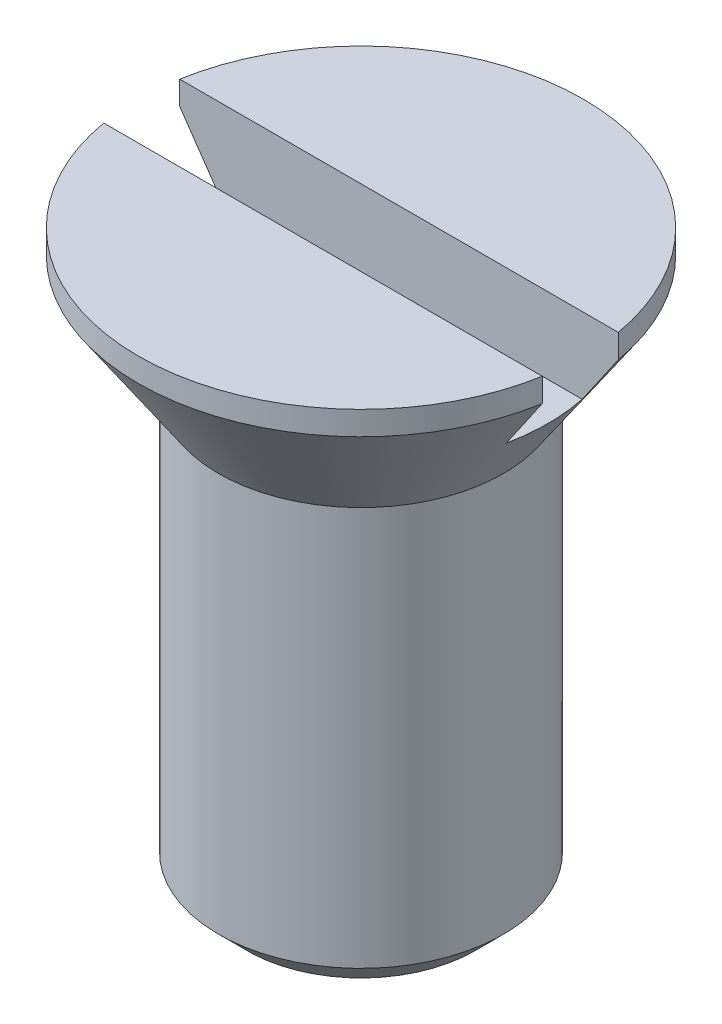
ISO-10303-21;
HEADER;
FILE_DESCRIPTION(('STEP AP214'),'2;1');
FILE_NAME('part.step','',(''),(''),'','','');
FILE_SCHEMA(('AUTOMOTIVE_DESIGN { 1 0 10303 214 1 1 1 1 }'));
ENDSEC;
DATA;
#1=APPLICATION_CONTEXT('core data for automotive mechanical design processes');
#2=APPLICATION_PROTOCOL_DEFINITION('international standard','automotive_design',2000,#1);
#3=PRODUCT_CONTEXT('',#1,'mechanical');
#4=PRODUCT('Part','Part','',(#3));
#5=PRODUCT_RELATED_PRODUCT_CATEGORY('part','',(#4));
#6=PRODUCT_DEFINITION_FORMATION('','',#4);
#7=PRODUCT_DEFINITION_CONTEXT('part definition',#1,'design');
#8=PRODUCT_DEFINITION('design','',#6,#7);
#9=PRODUCT_DEFINITION_SHAPE('','',#8);
#10=(LENGTH_UNIT() NAMED_UNIT(*) SI_UNIT(.MILLI.,.METRE.));
#11=(NAMED_UNIT(*) PLANE_ANGLE_UNIT() SI_UNIT($,.RADIAN.));
#12=(NAMED_UNIT(*) SI_UNIT($,.STERADIAN.) SOLID_ANGLE_UNIT());
#13=UNCERTAINTY_MEASURE_WITH_UNIT(LENGTH_MEASURE(1.E-05),#10,'distance_accuracy_value','');
#14=(GEOMETRIC_REPRESENTATION_CONTEXT(3) GLOBAL_UNCERTAINTY_ASSIGNED_CONTEXT((#13)) GLOBAL_UNIT_ASSIGNED_CONTEXT((#10,
#11,#12)) REPRESENTATION_CONTEXT('',''));
#15=CARTESIAN_POINT('',(0.,0.,0.));
#16=DIRECTION('',(0.,0.,1.));
#17=DIRECTION('',(1.,0.,0.));
#18=AXIS2_PLACEMENT_3D('',#15,#16,#17);
#19=CARTESIAN_POINT('',(0.,9.,0.));
#20=DIRECTION('',(0.,1.,0.));
#21=DIRECTION('',(-1.,0.,0.));
#22=AXIS2_PLACEMENT_3D('',#19,#20,#21);
#23=CONICAL_SURFACE('',#22,3.,0.596199141297479);
#24=CARTESIAN_POINT('',(0.,9.,0.));
#25=DIRECTION('',(0.,1.,0.));
#26=DIRECTION('',(-1.,0.,0.));
#27=AXIS2_PLACEMENT_3D('',#24,#25,#26);
#28=CIRCLE('',#27,3.);
#29=CARTESIAN_POINT('',(-3.,9.,0.));
#30=VERTEX_POINT('',#29);
#31=EDGE_CURVE('E174',#30,#30,#28,.T.);
#32=ORIENTED_EDGE('',*,*,#31,.T.);
#33=EDGE_LOOP('',(#32));
#34=FACE_BOUND('',#33,.T.);
#35=CARTESIAN_POINT('',(8.48774792603752,17.1426445816226,0.8));
#36=CARTESIAN_POINT('',(8.23226790905838,16.7678172243338,0.8));
#37=CARTESIAN_POINT('',(7.9767257733172,16.3930321664074,0.8));
#38=CARTESIAN_POINT('',(7.46545420852123,15.6435867536743,0.8));
#39=CARTESIAN_POINT('',(7.20972477842536,15.2689263995779,0.8));
#40=CARTESIAN_POINT('',(6.6979407636628,14.5196609936109,0.8));
#41=CARTESIAN_POINT('',(6.44188610385771,14.1450559930516,0.8));
#42=CARTESIAN_POINT('',(5.92942602025787,13.3960887615597,0.8));
#43=CARTESIAN_POINT('',(5.67302059825239,13.021726529403,0.8));
#44=CARTESIAN_POINT('',(5.15822446170194,12.2712181964029,0.8));
#45=CARTESIAN_POINT('',(4.89983077704055,11.8950741313497,0.8));
#46=CARTESIAN_POINT('',(4.38220973137272,11.1433516592533,0.8));
#47=CARTESIAN_POINT('',(4.12298235779023,10.7677732608699,0.8));
#48=CARTESIAN_POINT('',(3.60319777173905,10.0176542083952,0.8));
#49=CARTESIAN_POINT('',(3.34264085664451,9.64311334886867,0.8));
#50=CARTESIAN_POINT('',(2.94975937170716,9.08274250711056,0.8));
#51=CARTESIAN_POINT('',(2.81845949516172,8.89619460024518,0.8));
#52=CARTESIAN_POINT('',(2.5548285591623,8.52382947573319,0.8));
#53=CARTESIAN_POINT('',(2.42249750919383,8.33801225138882,0.8));
#54=CARTESIAN_POINT('',(2.23780306509317,8.08107308932591,0.8));
#55=CARTESIAN_POINT('',(2.18613435544891,8.00945210210963,0.8));
#56=CARTESIAN_POINT('',(2.08249051853665,7.86643190461051,0.8));
#57=CARTESIAN_POINT('',(2.03051538959882,7.7950326955395,0.8));
#58=CARTESIAN_POINT('',(1.87400922721423,7.58119896649876,0.8));
#59=CARTESIAN_POINT('',(1.76892476432942,7.43916652839808,0.8));
#60=CARTESIAN_POINT('',(1.60945321549017,7.22740761038801,0.8));
#61=CARTESIAN_POINT('',(1.55596431367076,7.15700518168541,0.8));
#62=CARTESIAN_POINT('',(1.44818752862893,7.01681537770636,0.8));
#63=CARTESIAN_POINT('',(1.3938996639495,6.94702798821549,0.8));
#64=CARTESIAN_POINT('',(1.28426875449672,6.80833307625839,0.8));
#65=CARTESIAN_POINT('',(1.22892616645992,6.73942519358727,0.8));
#66=CARTESIAN_POINT('',(1.11674412198701,6.60284245430155,0.8));
#67=CARTESIAN_POINT('',(1.05990484640698,6.53516745036572,0.8));
#68=CARTESIAN_POINT('',(0.965374802721835,6.42631017637344,0.8));
#69=CARTESIAN_POINT('',(0.928345808301923,6.38455473107146,0.8));
#70=CARTESIAN_POINT('',(0.853121589145389,6.30207556543701,0.8));
#71=CARTESIAN_POINT('',(0.814925980151197,6.2613521933075,0.8));
#72=CARTESIAN_POINT('',(0.737092842217356,6.18149090106563,0.8));
#73=CARTESIAN_POINT('',(0.697459055741308,6.14234935764564,0.8));
#74=CARTESIAN_POINT('',(0.616128163671504,6.06628931909247,0.8));
#75=CARTESIAN_POINT('',(0.57443250171318,6.02936930758979,0.8));
#76=CARTESIAN_POINT('',(0.496210683761102,5.96559946080604,0.8));
#77=CARTESIAN_POINT('',(0.460173760682992,5.93815679739466,0.8));
#78=CARTESIAN_POINT('',(0.385575386523169,5.88677725136391,0.8));
#79=CARTESIAN_POINT('',(0.347012363177795,5.86284258272924,0.8));
#80=CARTESIAN_POINT('',(0.272829834787472,5.82368663920412,0.8));
#81=CARTESIAN_POINT('',(0.237626097260866,5.80769877386264,0.8));
#82=CARTESIAN_POINT('',(0.165108730295448,5.78163881873884,0.8));
#83=CARTESIAN_POINT('',(0.127802246533531,5.77154787872296,0.8));
#84=CARTESIAN_POINT('',(0.05858331610283,5.76016570405149,0.8));
#85=CARTESIAN_POINT('',(0.0268801422085191,5.75763625703847,0.8));
#86=CARTESIAN_POINT('',(-0.0364725284535143,5.75819559107981,0.8));
#87=CARTESIAN_POINT('',(-0.0681220278444231,5.76128408916105,0.8));
#88=CARTESIAN_POINT('',(-0.137810731313606,5.7739307130832,0.8));
#89=CARTESIAN_POINT('',(-0.175597480771081,5.78484228907963,0.8));
#90=CARTESIAN_POINT('',(-0.248956464177001,5.81254336115259,0.8));
#91=CARTESIAN_POINT('',(-0.284521614702628,5.8293506302246,0.8));
#92=CARTESIAN_POINT('',(-0.36187294049137,5.87156232763636,0.8));
#93=CARTESIAN_POINT('',(-0.403044345976266,5.8980643342787,0.8));
#94=CARTESIAN_POINT('',(-0.482685383783973,5.95490719723634,0.8));
#95=CARTESIAN_POINT('',(-0.521148917347231,5.98525631339182,0.8));
#96=CARTESIAN_POINT('',(-0.596273570762443,6.04863916365644,0.8));
#97=CARTESIAN_POINT('',(-0.632918665314561,6.0816916458469,0.8));
#98=CARTESIAN_POINT('',(-0.704578118030376,6.14942572660821,0.8));
#99=CARTESIAN_POINT('',(-0.739594182163469,6.18410554085745,0.8));
#100=CARTESIAN_POINT('',(-0.812143769945838,6.25844698482739,0.8));
#101=CARTESIAN_POINT('',(-0.849540042731486,6.2982417923303,0.8));
#102=CARTESIAN_POINT('',(-0.92321969938439,6.37885190932487,0.8));
#103=CARTESIAN_POINT('',(-0.959502932633534,6.41966735558618,0.8));
#104=CARTESIAN_POINT('',(-1.06711358647309,6.54325860500914,0.8));
#105=CARTESIAN_POINT('',(-1.13716617725339,6.6271414839495,0.8));
#106=CARTESIAN_POINT('',(-1.27527959921153,6.79678134699001,0.8));
#107=CARTESIAN_POINT('',(-1.34333628499721,6.88254166327367,0.8));
#108=CARTESIAN_POINT('',(-1.47799221047606,7.05515744550461,0.8));
#109=CARTESIAN_POINT('',(-1.54459185920915,7.14201259301693,0.8));
#110=CARTESIAN_POINT('',(-1.67660343012007,7.31625104008622,0.8));
#111=CARTESIAN_POINT('',(-1.7420180630427,7.40363229320223,0.8));
#112=CARTESIAN_POINT('',(-1.8721166615278,7.57894588553599,0.8));
#113=CARTESIAN_POINT('',(-1.93680057499347,7.66687826336003,0.8));
#114=CARTESIAN_POINT('',(-2.0655398373215,7.84304482291375,0.8));
#115=CARTESIAN_POINT('',(-2.12959582891258,7.93127853556028,0.8));
#116=CARTESIAN_POINT('',(-2.25727802959564,8.10805279114734,0.8));
#117=CARTESIAN_POINT('',(-2.32090424928266,8.19659332644184,0.8));
#118=CARTESIAN_POINT('',(-2.51528649415403,8.46816614821653,0.8));
#119=CARTESIAN_POINT('',(-2.64549978403149,8.65158676507127,0.8));
#120=CARTESIAN_POINT('',(-2.90501205910948,9.01907408476338,0.8));
#121=CARTESIAN_POINT('',(-3.03431103791806,9.20314079210413,0.8));
#122=CARTESIAN_POINT('',(-3.4212904036935,9.75599743329053,0.8));
#123=CARTESIAN_POINT('',(-3.67804627767671,10.1254341080088,0.8));
#124=CARTESIAN_POINT('',(-4.19042935210392,10.8654115378665,0.8));
#125=CARTESIAN_POINT('',(-4.4460557917808,11.2359528183595,0.8));
#126=CARTESIAN_POINT('',(-4.95652743884542,11.9775654895549,0.8));
#127=CARTESIAN_POINT('',(-5.21137265705791,12.3486368728068,0.8));
#128=CARTESIAN_POINT('',(-5.71851239863128,13.0881253781531,0.8));
#129=CARTESIAN_POINT('',(-5.97081091408404,13.456539764296,0.8));
#130=CARTESIAN_POINT('',(-6.47507405690334,14.193599459476,0.8));
#131=CARTESIAN_POINT('',(-6.72703868271088,14.5622447695796,0.8));
#132=CARTESIAN_POINT('',(-7.23056078219798,15.2994489773699,0.8));
#133=CARTESIAN_POINT('',(-7.48211841583778,15.6680077658247,0.8));
#134=CARTESIAN_POINT('',(-7.98505346912793,16.4052455239468,0.8));
#135=CARTESIAN_POINT('',(-8.23643088969435,16.7739244929894,0.8));
#136=CARTESIAN_POINT('',(-8.48774792603752,17.1426445816226,0.8));
#137=B_SPLINE_CURVE_WITH_KNOTS('',3,(#35,#36,#37,#38,#39,#40,#41,#42,#43,#44,#45,#46,#47,#48,
#49,#50,#51,#52,#53,#54,#55,#56,#57,#58,#59,#60,#61,#62,#63,#64,#65,#66,#67,#68,#69,#70,#71,#72,
#73,#74,#75,#76,#77,#78,#79,#80,#81,#82,#83,#84,#85,#86,#87,#88,#89,#90,#91,#92,#93,#94,#95,#96,
#97,#98,#99,#100,#101,#102,#103,#104,#105,#106,#107,#108,#109,#110,#111,#112,#113,#114,#115,
#116,#117,#118,#119,#120,#121,#122,#123,#124,#125,#126,#127,#128,#129,#130,#131,#132,#133,#134,
#135,#136),.UNSPECIFIED.,.F.,.F.,(4,2,2,2,2,2,2,2,2,2,2,2,2,2,2,2,2,2,2,2,2,2,2,2,2,2,2,2,2,2,2,
2,2,2,2,2,2,2,2,2,2,2,2,2,2,2,2,2,2,2,4),(0.,1.36084179733033,2.72169121730867,4.08295373354408,
5.44420933146508,6.813246398183,8.18230421436707,9.55106818086802,10.2354332298726,
10.9197919909787,11.1847307600276,11.4496709741946,11.979692297306,12.2449394204521,
12.510180397201,12.775309012811,13.0404057366249,13.2078182161971,13.3752864454422,
13.5423463836438,13.7092909656505,13.8450509703109,13.9808962909805,14.0965290670016,
14.211790157859,14.3067204305578,14.401645921798,14.5189479798309,14.6366067362108,
14.7831351244319,14.9299836173654,15.0779546322718,15.2257670287381,15.3895639159838,
15.5533828715498,15.8811768682309,16.2096093519792,16.5379484186751,16.8654051706594,
17.1928851232388,17.5199847661501,17.8470763155258,18.5218952824489,19.1967189623764,
20.5464022977117,21.8968871023538,23.2473531090649,24.586924965816,25.9265030554256,
27.2651782458774,28.6038465825049),.UNSPECIFIED.);
#138=CARTESIAN_POINT('',(-3.85596162968843,10.3824273231753,0.8));
#139=VERTEX_POINT('',#138);
#140=CARTESIAN_POINT('',(-4.61568847683892,11.4824273231753,0.8));
#141=VERTEX_POINT('',#140);
#142=EDGE_CURVE('E61',#139,#141,#137,.T.);
#143=ORIENTED_EDGE('',*,*,#142,.F.);
#144=CARTESIAN_POINT('',(0.,10.3824273231753,0.));
#145=DIRECTION('',(0.,1.,0.));
#146=DIRECTION('',(0.,0.,1.));
#147=AXIS2_PLACEMENT_3D('',#144,#145,#146);
#148=CIRCLE('',#147,3.93807568358322);
#149=CARTESIAN_POINT('',(-3.85596162968843,10.3824273231753,-0.8));
#150=VERTEX_POINT('',#149);
#151=EDGE_CURVE('E11',#150,#139,#148,.T.);
#152=ORIENTED_EDGE('',*,*,#151,.F.);
#153=CARTESIAN_POINT('',(-8.48774792603752,17.1426445816226,-0.8));
#154=CARTESIAN_POINT('',(-8.23226790905838,16.7678172243338,-0.8));
#155=CARTESIAN_POINT('',(-7.9767257733172,16.3930321664074,-0.8));
#156=CARTESIAN_POINT('',(-7.46545420852124,15.6435867536743,-0.8));
#157=CARTESIAN_POINT('',(-7.20972477842536,15.2689263995779,-0.8));
#158=CARTESIAN_POINT('',(-6.6979407636628,14.5196609936109,-0.8));
#159=CARTESIAN_POINT('',(-6.44188610385771,14.1450559930516,-0.8));
#160=CARTESIAN_POINT('',(-5.92942602025787,13.3960887615597,-0.8));
#161=CARTESIAN_POINT('',(-5.67302059825239,13.021726529403,-0.8));
#162=CARTESIAN_POINT('',(-5.15822446170195,12.2712181964029,-0.8));
#163=CARTESIAN_POINT('',(-4.89983077704055,11.8950741313497,-0.8));
#164=CARTESIAN_POINT('',(-4.38220973137272,11.1433516592533,-0.8));
#165=CARTESIAN_POINT('',(-4.12298235779023,10.7677732608699,-0.8));
#166=CARTESIAN_POINT('',(-3.60319777173905,10.0176542083952,-0.8));
#167=CARTESIAN_POINT('',(-3.34264085664451,9.64311334886867,-0.8));
#168=CARTESIAN_POINT('',(-2.94975937170716,9.08274250711056,-0.8));
#169=CARTESIAN_POINT('',(-2.81845949516172,8.89619460024518,-0.8));
#170=CARTESIAN_POINT('',(-2.5548285591623,8.52382947573319,-0.8));
#171=CARTESIAN_POINT('',(-2.42249750919383,8.33801225138882,-0.8));
#172=CARTESIAN_POINT('',(-2.23780306509317,8.08107308932591,-0.8));
#173=CARTESIAN_POINT('',(-2.18613435544891,8.00945210210963,-0.8));
#174=CARTESIAN_POINT('',(-2.08249051853665,7.86643190461051,-0.8));
#175=CARTESIAN_POINT('',(-2.03051538959882,7.7950326955395,-0.8));
#176=CARTESIAN_POINT('',(-1.87400922721423,7.58119896649877,-0.8));
#177=CARTESIAN_POINT('',(-1.76892476432943,7.43916652839808,-0.8));
#178=CARTESIAN_POINT('',(-1.60945321549017,7.22740761038801,-0.8));
#179=CARTESIAN_POINT('',(-1.55596431367076,7.15700518168541,-0.8));
#180=CARTESIAN_POINT('',(-1.44818752862893,7.01681537770636,-0.8));
#181=CARTESIAN_POINT('',(-1.3938996639495,6.94702798821549,-0.8));
#182=CARTESIAN_POINT('',(-1.28426875449672,6.80833307625839,-0.8));
#183=CARTESIAN_POINT('',(-1.22892616645993,6.73942519358728,-0.8));
#184=CARTESIAN_POINT('',(-1.11674412198701,6.60284245430155,-0.8));
#185=CARTESIAN_POINT('',(-1.05990484640698,6.53516745036572,-0.8));
#186=CARTESIAN_POINT('',(-0.965374802721835,6.42631017637344,-0.8));
#187=CARTESIAN_POINT('',(-0.928345808301923,6.38455473107146,-0.8));
#188=CARTESIAN_POINT('',(-0.853121589145389,6.30207556543701,-0.8));
#189=CARTESIAN_POINT('',(-0.814925980151197,6.2613521933075,-0.8));
#190=CARTESIAN_POINT('',(-0.737092842217356,6.18149090106563,-0.8));
#191=CARTESIAN_POINT('',(-0.697459055741309,6.14234935764564,-0.8));
#192=CARTESIAN_POINT('',(-0.616128163671505,6.06628931909247,-0.8));
#193=CARTESIAN_POINT('',(-0.57443250171318,6.02936930758979,-0.8));
#194=CARTESIAN_POINT('',(-0.496210683761101,5.96559946080604,-0.8));
#195=CARTESIAN_POINT('',(-0.460173760682991,5.93815679739466,-0.8));
#196=CARTESIAN_POINT('',(-0.385575386523168,5.88677725136391,-0.8));
#197=CARTESIAN_POINT('',(-0.347012363177795,5.86284258272925,-0.8));
#198=CARTESIAN_POINT('',(-0.272829834787472,5.82368663920412,-0.8));
#199=CARTESIAN_POINT('',(-0.237626097260867,5.80769877386264,-0.8));
#200=CARTESIAN_POINT('',(-0.165108730295449,5.78163881873884,-0.8));
#201=CARTESIAN_POINT('',(-0.127802246533532,5.77154787872296,-0.8));
#202=CARTESIAN_POINT('',(-0.0585833161028306,5.76016570405149,-0.8));
#203=CARTESIAN_POINT('',(-0.0268801422085197,5.75763625703847,-0.8));
#204=CARTESIAN_POINT('',(0.0364725284535137,5.75819559107981,-0.8));
#205=CARTESIAN_POINT('',(0.0681220278444225,5.76128408916105,-0.8));
#206=CARTESIAN_POINT('',(0.137810731313605,5.7739307130832,-0.8));
#207=CARTESIAN_POINT('',(0.17559748077108,5.78484228907963,-0.8));
#208=CARTESIAN_POINT('',(0.248956464177,5.81254336115259,-0.8));
#209=CARTESIAN_POINT('',(0.284521614702628,5.8293506302246,-0.8));
#210=CARTESIAN_POINT('',(0.361872940491369,5.87156232763636,-0.8));
#211=CARTESIAN_POINT('',(0.403044345976265,5.8980643342787,-0.8));
#212=CARTESIAN_POINT('',(0.482685383783973,5.95490719723634,-0.8));
#213=CARTESIAN_POINT('',(0.521148917347229,5.98525631339182,-0.8));
#214=CARTESIAN_POINT('',(0.59627357076244,6.04863916365644,-0.8));
#215=CARTESIAN_POINT('',(0.632918665314558,6.0816916458469,-0.8));
#216=CARTESIAN_POINT('',(0.704578118030373,6.1494257266082,-0.8));
#217=CARTESIAN_POINT('',(0.739594182163467,6.18410554085744,-0.8));
#218=CARTESIAN_POINT('',(0.812143769945836,6.25844698482739,-0.8));
#219=CARTESIAN_POINT('',(0.849540042731484,6.2982417923303,-0.8));
#220=CARTESIAN_POINT('',(0.923219699384388,6.37885190932486,-0.8));
#221=CARTESIAN_POINT('',(0.959502932633532,6.41966735558618,-0.8));
#222=CARTESIAN_POINT('',(1.06711358647308,6.54325860500914,-0.8));
#223=CARTESIAN_POINT('',(1.13716617725339,6.6271414839495,-0.8));
#224=CARTESIAN_POINT('',(1.27527959921153,6.79678134699,-0.8));
#225=CARTESIAN_POINT('',(1.3433362849972,6.88254166327367,-0.8));
#226=CARTESIAN_POINT('',(1.47799221047606,7.0551574455046,-0.8));
#227=CARTESIAN_POINT('',(1.54459185920914,7.14201259301692,-0.8));
#228=CARTESIAN_POINT('',(1.67660343012006,7.31625104008622,-0.8));
#229=CARTESIAN_POINT('',(1.7420180630427,7.40363229320223,-0.8));
#230=CARTESIAN_POINT('',(1.87211666152779,7.57894588553598,-0.8));
#231=CARTESIAN_POINT('',(1.93680057499347,7.66687826336002,-0.8));
#232=CARTESIAN_POINT('',(2.0655398373215,7.84304482291374,-0.8));
#233=CARTESIAN_POINT('',(2.12959582891257,7.93127853556027,-0.8));
#234=CARTESIAN_POINT('',(2.25727802959563,8.10805279114732,-0.8));
#235=CARTESIAN_POINT('',(2.32090424928265,8.19659332644183,-0.8));
#236=CARTESIAN_POINT('',(2.51528649415402,8.46816614821652,-0.8));
#237=CARTESIAN_POINT('',(2.64549978403148,8.65158676507126,-0.8));
#238=CARTESIAN_POINT('',(2.90501205910947,9.01907408476337,-0.8));
#239=CARTESIAN_POINT('',(3.03431103791806,9.20314079210412,-0.8));
#240=CARTESIAN_POINT('',(3.4212904036935,9.75599743329053,-0.8));
#241=CARTESIAN_POINT('',(3.67804627767671,10.1254341080088,-0.8));
#242=CARTESIAN_POINT('',(4.19042935210392,10.8654115378665,-0.8));
#243=CARTESIAN_POINT('',(4.4460557917808,11.2359528183595,-0.8));
#244=CARTESIAN_POINT('',(4.95652743884542,11.9775654895549,-0.8));
#245=CARTESIAN_POINT('',(5.21137265705791,12.3486368728068,-0.8));
#246=CARTESIAN_POINT('',(5.71851239863127,13.0881253781531,-0.8));
#247=CARTESIAN_POINT('',(5.97081091408404,13.456539764296,-0.8));
#248=CARTESIAN_POINT('',(6.47507405690334,14.193599459476,-0.8));
#249=CARTESIAN_POINT('',(6.72703868271088,14.5622447695796,-0.8));
#250=CARTESIAN_POINT('',(7.23056078219798,15.2994489773699,-0.8));
#251=CARTESIAN_POINT('',(7.48211841583777,15.6680077658247,-0.8));
#252=CARTESIAN_POINT('',(7.98505346912792,16.4052455239468,-0.8));
#253=CARTESIAN_POINT('',(8.23643088969435,16.7739244929894,-0.8));
#254=CARTESIAN_POINT('',(8.48774792603752,17.1426445816226,-0.8));
#255=B_SPLINE_CURVE_WITH_KNOTS('',3,(#153,#154,#155,#156,#157,#158,#159,#160,#161,#162,#163,
#164,#165,#166,#167,#168,#169,#170,#171,#172,#173,#174,#175,#176,#177,#178,#179,#180,#181,#182,
#183,#184,#185,#186,#187,#188,#189,#190,#191,#192,#193,#194,#195,#196,#197,#198,#199,#200,#201,
#202,#203,#204,#205,#206,#207,#208,#209,#210,#211,#212,#213,#214,#215,#216,#217,#218,#219,#220,
#221,#222,#223,#224,#225,#226,#227,#228,#229,#230,#231,#232,#233,#234,#235,#236,#237,#238,#239,
#240,#241,#242,#243,#244,#245,#246,#247,#248,#249,#250,#251,#252,#253,#254),.UNSPECIFIED.,.F.,
.F.,(4,2,2,2,2,2,2,2,2,2,2,2,2,2,2,2,2,2,2,2,2,2,2,2,2,2,2,2,2,2,2,2,2,2,2,2,2,2,2,2,2,2,2,2,2,
2,2,2,2,2,4),(0.,1.36084179733033,2.72169121730867,4.08295373354409,5.44420933146509,
6.813246398183,8.18230421436707,9.55106818086803,10.2354332298726,10.9197919909787,
11.1847307600276,11.4496709741946,11.979692297306,12.2449394204521,12.510180397201,
12.775309012811,13.0404057366249,13.2078182161971,13.3752864454422,13.5423463836438,
13.7092909656505,13.8450509703109,13.9808962909806,14.0965290670016,14.211790157859,
14.3067204305578,14.401645921798,14.5189479798309,14.6366067362108,14.7831351244319,
14.9299836173654,15.0779546322718,15.2257670287381,15.3895639159838,15.5533828715498,
15.8811768682309,16.2096093519792,16.537948418675,16.8654051706594,17.1928851232388,
17.5199847661501,17.8470763155258,18.5218952824489,19.1967189623764,20.5464022977117,
21.8968871023538,23.2473531090649,24.586924965816,25.9265030554257,27.2651782458774,
28.6038465825049),.UNSPECIFIED.);
#256=CARTESIAN_POINT('',(-4.61568847683892,11.4824273231753,-0.8));
#257=VERTEX_POINT('',#256);
#258=EDGE_CURVE('E104',#257,#150,#255,.T.);
#259=ORIENTED_EDGE('',*,*,#258,.F.);
#260=CARTESIAN_POINT('',(0.,11.4824273231753,0.));
#261=DIRECTION('',(0.,1.,0.));
#262=DIRECTION('',(-1.,0.,0.));
#263=AXIS2_PLACEMENT_3D('',#260,#261,#262);
#264=CIRCLE('',#263,4.68450425501179);
#265=CARTESIAN_POINT('',(4.61568847683892,11.4824273231753,-0.8));
#266=VERTEX_POINT('',#265);
#267=EDGE_CURVE('E108',#266,#257,#264,.T.);
#268=ORIENTED_EDGE('',*,*,#267,.F.);
#269=CARTESIAN_POINT('',(3.85596162968843,10.3824273231753,-0.8));
#270=VERTEX_POINT('',#269);
#271=EDGE_CURVE('E102',#270,#266,#255,.T.);
#272=ORIENTED_EDGE('',*,*,#271,.F.);
#273=CARTESIAN_POINT('',(3.85596162968843,10.3824273231753,0.8));
#274=VERTEX_POINT('',#273);
#275=EDGE_CURVE('E42',#274,#270,#148,.T.);
#276=ORIENTED_EDGE('',*,*,#275,.F.);
#277=CARTESIAN_POINT('',(4.61568847683892,11.4824273231753,0.8));
#278=VERTEX_POINT('',#277);
#279=EDGE_CURVE('E111',#278,#274,#137,.T.);
#280=ORIENTED_EDGE('',*,*,#279,.F.);
#281=EDGE_CURVE('E127',#141,#278,#264,.T.);
#282=ORIENTED_EDGE('',*,*,#281,.F.);
#283=EDGE_LOOP('',(#143,#152,#259,#268,#272,#276,#280,#282));
#284=FACE_BOUND('',#283,.T.);
#285=ADVANCED_FACE('F38',(#34,#284),#23,.T.);
#286=CARTESIAN_POINT('',(0.,11.9824273231753,0.));
#287=DIRECTION('',(0.,1.,0.));
#288=DIRECTION('',(-1.,0.,0.));
#289=AXIS2_PLACEMENT_3D('',#286,#287,#288);
#290=CYLINDRICAL_SURFACE('',#289,4.68450425501179);
#291=DIRECTION('',(0.,1.,0.));
#292=VECTOR('',#291,1.);
#293=CARTESIAN_POINT('',(-4.61568847683892,11.9824273231753,0.8));
#294=LINE('',#293,#292);
#295=CARTESIAN_POINT('',(-4.61568847683892,11.9824273231753,0.8));
#296=VERTEX_POINT('',#295);
#297=EDGE_CURVE('E129',#141,#296,#294,.T.);
#298=ORIENTED_EDGE('',*,*,#297,.F.);
#299=ORIENTED_EDGE('',*,*,#281,.T.);
#300=DIRECTION('',(0.,1.,0.));
#301=VECTOR('',#300,1.);
#302=CARTESIAN_POINT('',(4.61568847683892,11.9824273231753,0.8));
#303=LINE('',#302,#301);
#304=CARTESIAN_POINT('',(4.61568847683892,11.9824273231753,0.8));
#305=VERTEX_POINT('',#304);
#306=EDGE_CURVE('E109',#305,#278,#303,.F.);
#307=ORIENTED_EDGE('',*,*,#306,.F.);
#308=CARTESIAN_POINT('',(0.,11.9824273231753,0.));
#309=DIRECTION('',(0.,1.,0.));
#310=DIRECTION('',(-1.,0.,0.));
#311=AXIS2_PLACEMENT_3D('',#308,#309,#310);
#312=CIRCLE('',#311,4.68450425501179);
#313=EDGE_CURVE('E132',#296,#305,#312,.T.);
#314=ORIENTED_EDGE('',*,*,#313,.F.);
#315=EDGE_LOOP('',(#298,#299,#307,#314));
#316=FACE_BOUND('',#315,.T.);
#317=ADVANCED_FACE('F152',(#316),#290,.T.);
#318=DIRECTION('',(0.,1.,0.));
#319=VECTOR('',#318,1.);
#320=CARTESIAN_POINT('',(4.61568847683892,11.9824273231753,-0.8));
#321=LINE('',#320,#319);
#322=CARTESIAN_POINT('',(4.61568847683892,11.9824273231753,-0.8));
#323=VERTEX_POINT('',#322);
#324=EDGE_CURVE('E53',#266,#323,#321,.T.);
#325=ORIENTED_EDGE('',*,*,#324,.F.);
#326=ORIENTED_EDGE('',*,*,#267,.T.);
#327=DIRECTION('',(0.,1.,0.));
#328=VECTOR('',#327,1.);
#329=CARTESIAN_POINT('',(-4.61568847683892,11.9824273231753,-0.8));
#330=LINE('',#329,#328);
#331=CARTESIAN_POINT('',(-4.61568847683892,11.9824273231753,-0.8));
#332=VERTEX_POINT('',#331);
#333=EDGE_CURVE('E121',#332,#257,#330,.F.);
#334=ORIENTED_EDGE('',*,*,#333,.F.);
#335=EDGE_CURVE('E128',#323,#332,#312,.T.);
#336=ORIENTED_EDGE('',*,*,#335,.F.);
#337=EDGE_LOOP('',(#325,#326,#334,#336));
#338=FACE_BOUND('',#337,.T.);
#339=ADVANCED_FACE('F150',(#338),#290,.T.);
#340=CARTESIAN_POINT('',(4.68450425501179,11.9824273231753,0.));
#341=DIRECTION('',(0.,-1.,0.));
#342=DIRECTION('',(1.,0.,0.));
#343=AXIS2_PLACEMENT_3D('',#340,#341,#342);
#344=PLANE('',#343);
#345=DIRECTION('',(1.,0.,0.));
#346=VECTOR('',#345,1.);
#347=CARTESIAN_POINT('',(4.68450425501179,11.9824273231753,0.8));
#348=LINE('',#347,#346);
#349=EDGE_CURVE('E100',#296,#305,#348,.T.);
#350=ORIENTED_EDGE('',*,*,#349,.F.);
#351=ORIENTED_EDGE('',*,*,#313,.T.);
#352=EDGE_LOOP('',(#350,#351));
#353=FACE_BOUND('',#352,.T.);
#354=ADVANCED_FACE('F147',(#353),#344,.F.);
#355=DIRECTION('',(-1.,0.,0.));
#356=VECTOR('',#355,1.);
#357=CARTESIAN_POINT('',(4.68450425501179,11.9824273231753,-0.8));
#358=LINE('',#357,#356);
#359=EDGE_CURVE('E165',#323,#332,#358,.T.);
#360=ORIENTED_EDGE('',*,*,#359,.F.);
#361=ORIENTED_EDGE('',*,*,#335,.T.);
#362=EDGE_LOOP('',(#360,#361));
#363=FACE_BOUND('',#362,.T.);
#364=ADVANCED_FACE('F149',(#363),#344,.F.);
#365=CARTESIAN_POINT('',(0.,0.,0.));
#366=DIRECTION('',(0.,1.,0.));
#367=DIRECTION('',(-1.,0.,0.));
#368=AXIS2_PLACEMENT_3D('',#365,#366,#367);
#369=PLANE('',#368);
#370=CARTESIAN_POINT('',(0.,0.,0.));
#371=DIRECTION('',(0.,1.,0.));
#372=DIRECTION('',(-1.,0.,0.));
#373=AXIS2_PLACEMENT_3D('',#370,#371,#372);
#374=CIRCLE('',#373,2.4);
#375=CARTESIAN_POINT('',(-2.4,0.,0.));
#376=VERTEX_POINT('',#375);
#377=EDGE_CURVE('E166',#376,#376,#374,.F.);
#378=ORIENTED_EDGE('',*,*,#377,.T.);
#379=EDGE_LOOP('',(#378));
#380=FACE_BOUND('',#379,.T.);
#381=ADVANCED_FACE('F180',(#380),#369,.F.);
#382=CARTESIAN_POINT('',(0.,11.9824273231753,0.));
#383=DIRECTION('',(0.,1.,0.));
#384=DIRECTION('',(-1.,0.,0.));
#385=AXIS2_PLACEMENT_3D('',#382,#383,#384);
#386=CYLINDRICAL_SURFACE('',#385,3.);
#387=CARTESIAN_POINT('',(0.,0.599999999999998,0.));
#388=DIRECTION('',(0.,1.,0.));
#389=DIRECTION('',(-1.,0.,0.));
#390=AXIS2_PLACEMENT_3D('',#387,#388,#389);
#391=CIRCLE('',#390,3.);
#392=CARTESIAN_POINT('',(-3.,0.599999999999998,0.));
#393=VERTEX_POINT('',#392);
#394=EDGE_CURVE('E171',#393,#393,#391,.T.);
#395=ORIENTED_EDGE('',*,*,#394,.T.);
#396=EDGE_LOOP('',(#395));
#397=FACE_BOUND('',#396,.T.);
#398=ORIENTED_EDGE('',*,*,#31,.F.);
#399=EDGE_LOOP('',(#398));
#400=FACE_BOUND('',#399,.T.);
#401=ADVANCED_FACE('F184',(#397,#400),#386,.T.);
#402=CARTESIAN_POINT('',(0.,0.599999999999998,0.));
#403=DIRECTION('',(0.,1.,0.));
#404=DIRECTION('',(-1.,0.,0.));
#405=AXIS2_PLACEMENT_3D('',#402,#403,#404);
#406=CONICAL_SURFACE('',#405,3.,0.78539816339745);
#407=ORIENTED_EDGE('',*,*,#377,.F.);
#408=EDGE_LOOP('',(#407));
#409=FACE_BOUND('',#408,.T.);
#410=ORIENTED_EDGE('',*,*,#394,.F.);
#411=EDGE_LOOP('',(#410));
#412=FACE_BOUND('',#411,.T.);
#413=ADVANCED_FACE('F40',(#409,#412),#406,.T.);
#414=CARTESIAN_POINT('',(10.,10.3824273231753,0.8));
#415=DIRECTION('',(0.,1.,0.));
#416=DIRECTION('',(0.,0.,1.));
#417=AXIS2_PLACEMENT_3D('',#414,#415,#416);
#418=PLANE('',#417);
#419=ORIENTED_EDGE('',*,*,#275,.T.);
#420=DIRECTION('',(-1.,0.,0.));
#421=VECTOR('',#420,1.);
#422=CARTESIAN_POINT('',(10.,10.3824273231753,-0.8));
#423=LINE('',#422,#421);
#424=EDGE_CURVE('E94',#270,#150,#423,.T.);
#425=ORIENTED_EDGE('',*,*,#424,.T.);
#426=ORIENTED_EDGE('',*,*,#151,.T.);
#427=DIRECTION('',(-1.,0.,0.));
#428=VECTOR('',#427,1.);
#429=CARTESIAN_POINT('',(10.,10.3824273231753,0.8));
#430=LINE('',#429,#428);
#431=EDGE_CURVE('E96',#274,#139,#430,.T.);
#432=ORIENTED_EDGE('',*,*,#431,.F.);
#433=EDGE_LOOP('',(#419,#425,#426,#432));
#434=FACE_BOUND('',#433,.T.);
#435=ADVANCED_FACE('F93',(#434),#418,.T.);
#436=CARTESIAN_POINT('',(10.,11.9824273231753,0.8));
#437=DIRECTION('',(0.,0.,-1.));
#438=DIRECTION('',(0.,1.,0.));
#439=AXIS2_PLACEMENT_3D('',#436,#437,#438);
#440=PLANE('',#439);
#441=ORIENTED_EDGE('',*,*,#142,.T.);
#442=ORIENTED_EDGE('',*,*,#297,.T.);
#443=ORIENTED_EDGE('',*,*,#349,.T.);
#444=ORIENTED_EDGE('',*,*,#306,.T.);
#445=ORIENTED_EDGE('',*,*,#279,.T.);
#446=ORIENTED_EDGE('',*,*,#431,.T.);
#447=EDGE_LOOP('',(#441,#442,#443,#444,#445,#446));
#448=FACE_BOUND('',#447,.T.);
#449=ADVANCED_FACE('F124',(#448),#440,.T.);
#450=CARTESIAN_POINT('',(10.,10.3824273231753,-0.8));
#451=DIRECTION('',(0.,0.,1.));
#452=DIRECTION('',(1.,0.,0.));
#453=AXIS2_PLACEMENT_3D('',#450,#451,#452);
#454=PLANE('',#453);
#455=ORIENTED_EDGE('',*,*,#271,.T.);
#456=ORIENTED_EDGE('',*,*,#324,.T.);
#457=ORIENTED_EDGE('',*,*,#359,.T.);
#458=ORIENTED_EDGE('',*,*,#333,.T.);
#459=ORIENTED_EDGE('',*,*,#258,.T.);
#460=ORIENTED_EDGE('',*,*,#424,.F.);
#461=EDGE_LOOP('',(#455,#456,#457,#458,#459,#460));
#462=FACE_BOUND('',#461,.T.);
#463=ADVANCED_FACE('F101',(#462),#454,.T.);
#464=CLOSED_SHELL('',(#285,#317,#339,#354,#364,#381,#401,#413,#435,#449,#463));
#465=MANIFOLD_SOLID_BREP('B2',#464);
#466=ADVANCED_BREP_SHAPE_REPRESENTATION('',(#18,#465),#14);
#467=SHAPE_DEFINITION_REPRESENTATION(#9,#466);
ENDSEC;
END-ISO-10303-21;
